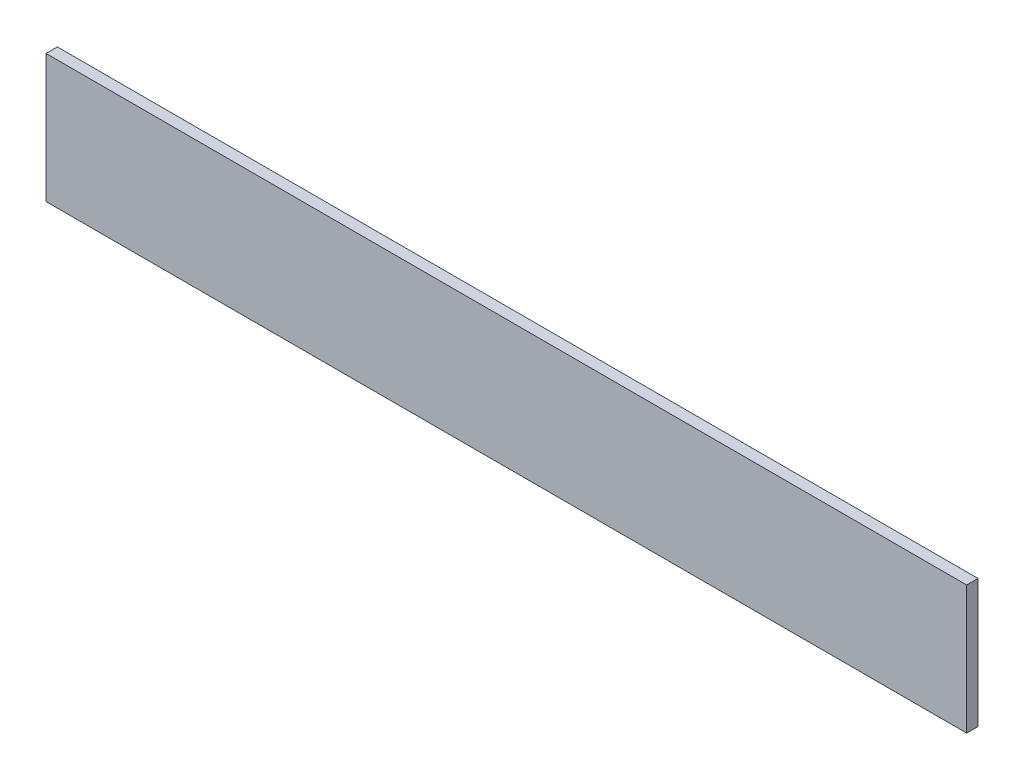
ISO-10303-21;
HEADER;
FILE_DESCRIPTION(('STEP AP214'),'2;1');
FILE_NAME('part.step','',(''),(''),'','','');
FILE_SCHEMA(('AUTOMOTIVE_DESIGN { 1 0 10303 214 1 1 1 1 }'));
ENDSEC;
DATA;
#1=APPLICATION_CONTEXT('core data for automotive mechanical design processes');
#2=APPLICATION_PROTOCOL_DEFINITION('international standard','automotive_design',2000,#1);
#3=PRODUCT_CONTEXT('',#1,'mechanical');
#4=PRODUCT('Part','Part','',(#3));
#5=PRODUCT_RELATED_PRODUCT_CATEGORY('part','',(#4));
#6=PRODUCT_DEFINITION_FORMATION('','',#4);
#7=PRODUCT_DEFINITION_CONTEXT('part definition',#1,'design');
#8=PRODUCT_DEFINITION('design','',#6,#7);
#9=PRODUCT_DEFINITION_SHAPE('','',#8);
#10=(LENGTH_UNIT() NAMED_UNIT(*) SI_UNIT(.MILLI.,.METRE.));
#11=(NAMED_UNIT(*) PLANE_ANGLE_UNIT() SI_UNIT($,.RADIAN.));
#12=(NAMED_UNIT(*) SI_UNIT($,.STERADIAN.) SOLID_ANGLE_UNIT());
#13=UNCERTAINTY_MEASURE_WITH_UNIT(LENGTH_MEASURE(1.E-05),#10,'distance_accuracy_value','');
#14=(GEOMETRIC_REPRESENTATION_CONTEXT(3) GLOBAL_UNCERTAINTY_ASSIGNED_CONTEXT((#13)) GLOBAL_UNIT_ASSIGNED_CONTEXT((#10,
#11,#12)) REPRESENTATION_CONTEXT('',''));
#15=CARTESIAN_POINT('',(0.,0.,0.));
#16=DIRECTION('',(0.,0.,1.));
#17=DIRECTION('',(1.,0.,0.));
#18=AXIS2_PLACEMENT_3D('',#15,#16,#17);
#19=CARTESIAN_POINT('',(61.,-8.5,1.5));
#20=DIRECTION('',(-1.,0.,0.));
#21=DIRECTION('',(0.,0.,1.));
#22=AXIS2_PLACEMENT_3D('',#19,#20,#21);
#23=PLANE('',#22);
#24=DIRECTION('',(0.,1.,0.));
#25=VECTOR('',#24,1.);
#26=CARTESIAN_POINT('',(61.,-8.5,0.));
#27=LINE('',#26,#25);
#28=CARTESIAN_POINT('',(61.,-8.5,0.));
#29=VERTEX_POINT('',#28);
#30=CARTESIAN_POINT('',(61.,8.5,0.));
#31=VERTEX_POINT('',#30);
#32=EDGE_CURVE('E96',#29,#31,#27,.T.);
#33=ORIENTED_EDGE('',*,*,#32,.T.);
#34=DIRECTION('',(0.,0.,-1.));
#35=VECTOR('',#34,1.);
#36=CARTESIAN_POINT('',(61.,8.5,1.5));
#37=LINE('',#36,#35);
#38=CARTESIAN_POINT('',(61.,8.5,1.5));
#39=VERTEX_POINT('',#38);
#40=EDGE_CURVE('E11',#39,#31,#37,.T.);
#41=ORIENTED_EDGE('',*,*,#40,.F.);
#42=DIRECTION('',(0.,1.,0.));
#43=VECTOR('',#42,1.);
#44=CARTESIAN_POINT('',(61.,-8.5,1.5));
#45=LINE('',#44,#43);
#46=CARTESIAN_POINT('',(61.,-8.5,1.5));
#47=VERTEX_POINT('',#46);
#48=EDGE_CURVE('E84',#47,#39,#45,.T.);
#49=ORIENTED_EDGE('',*,*,#48,.F.);
#50=DIRECTION('',(0.,0.,-1.));
#51=VECTOR('',#50,1.);
#52=CARTESIAN_POINT('',(61.,-8.5,1.5));
#53=LINE('',#52,#51);
#54=EDGE_CURVE('E92',#47,#29,#53,.T.);
#55=ORIENTED_EDGE('',*,*,#54,.T.);
#56=EDGE_LOOP('',(#33,#41,#49,#55));
#57=FACE_BOUND('',#56,.T.);
#58=ADVANCED_FACE('F33',(#57),#23,.F.);
#59=CARTESIAN_POINT('',(-61.,8.5,1.5));
#60=DIRECTION('',(0.,-1.,0.));
#61=DIRECTION('',(0.,0.,-1.));
#62=AXIS2_PLACEMENT_3D('',#59,#60,#61);
#63=PLANE('',#62);
#64=DIRECTION('',(-1.,0.,0.));
#65=VECTOR('',#64,1.);
#66=CARTESIAN_POINT('',(-61.,8.5,0.));
#67=LINE('',#66,#65);
#68=CARTESIAN_POINT('',(-61.,8.5,0.));
#69=VERTEX_POINT('',#68);
#70=EDGE_CURVE('E88',#31,#69,#67,.T.);
#71=ORIENTED_EDGE('',*,*,#70,.T.);
#72=DIRECTION('',(0.,0.,-1.));
#73=VECTOR('',#72,1.);
#74=CARTESIAN_POINT('',(-61.,8.5,1.5));
#75=LINE('',#74,#73);
#76=CARTESIAN_POINT('',(-61.,8.5,1.5));
#77=VERTEX_POINT('',#76);
#78=EDGE_CURVE('E41',#77,#69,#75,.T.);
#79=ORIENTED_EDGE('',*,*,#78,.F.);
#80=DIRECTION('',(-1.,0.,0.));
#81=VECTOR('',#80,1.);
#82=CARTESIAN_POINT('',(-61.,8.5,1.5));
#83=LINE('',#82,#81);
#84=EDGE_CURVE('E79',#39,#77,#83,.T.);
#85=ORIENTED_EDGE('',*,*,#84,.F.);
#86=ORIENTED_EDGE('',*,*,#40,.T.);
#87=EDGE_LOOP('',(#71,#79,#85,#86));
#88=FACE_BOUND('',#87,.T.);
#89=ADVANCED_FACE('F87',(#88),#63,.F.);
#90=CARTESIAN_POINT('',(-61.,-8.5,1.5));
#91=DIRECTION('',(1.,0.,0.));
#92=DIRECTION('',(0.,0.,-1.));
#93=AXIS2_PLACEMENT_3D('',#90,#91,#92);
#94=PLANE('',#93);
#95=DIRECTION('',(0.,-1.,0.));
#96=VECTOR('',#95,1.);
#97=CARTESIAN_POINT('',(-61.,-8.5,0.));
#98=LINE('',#97,#96);
#99=CARTESIAN_POINT('',(-61.,-8.5,0.));
#100=VERTEX_POINT('',#99);
#101=EDGE_CURVE('E66',#69,#100,#98,.T.);
#102=ORIENTED_EDGE('',*,*,#101,.T.);
#103=DIRECTION('',(0.,0.,-1.));
#104=VECTOR('',#103,1.);
#105=CARTESIAN_POINT('',(-61.,-8.5,1.5));
#106=LINE('',#105,#104);
#107=CARTESIAN_POINT('',(-61.,-8.5,1.5));
#108=VERTEX_POINT('',#107);
#109=EDGE_CURVE('E89',#108,#100,#106,.T.);
#110=ORIENTED_EDGE('',*,*,#109,.F.);
#111=DIRECTION('',(0.,-1.,0.));
#112=VECTOR('',#111,1.);
#113=CARTESIAN_POINT('',(-61.,-8.5,1.5));
#114=LINE('',#113,#112);
#115=EDGE_CURVE('E82',#77,#108,#114,.T.);
#116=ORIENTED_EDGE('',*,*,#115,.F.);
#117=ORIENTED_EDGE('',*,*,#78,.T.);
#118=EDGE_LOOP('',(#102,#110,#116,#117));
#119=FACE_BOUND('',#118,.T.);
#120=ADVANCED_FACE('F90',(#119),#94,.F.);
#121=CARTESIAN_POINT('',(-61.,-8.5,1.5));
#122=DIRECTION('',(0.,1.,0.));
#123=DIRECTION('',(-1.,0.,0.));
#124=AXIS2_PLACEMENT_3D('',#121,#122,#123);
#125=PLANE('',#124);
#126=DIRECTION('',(1.,0.,0.));
#127=VECTOR('',#126,1.);
#128=CARTESIAN_POINT('',(-61.,-8.5,0.));
#129=LINE('',#128,#127);
#130=EDGE_CURVE('E72',#100,#29,#129,.T.);
#131=ORIENTED_EDGE('',*,*,#130,.T.);
#132=ORIENTED_EDGE('',*,*,#54,.F.);
#133=DIRECTION('',(1.,0.,0.));
#134=VECTOR('',#133,1.);
#135=CARTESIAN_POINT('',(-61.,-8.5,1.5));
#136=LINE('',#135,#134);
#137=EDGE_CURVE('E49',#108,#47,#136,.T.);
#138=ORIENTED_EDGE('',*,*,#137,.F.);
#139=ORIENTED_EDGE('',*,*,#109,.T.);
#140=EDGE_LOOP('',(#131,#132,#138,#139));
#141=FACE_BOUND('',#140,.T.);
#142=ADVANCED_FACE('F103',(#141),#125,.F.);
#143=CARTESIAN_POINT('',(0.,0.,1.5));
#144=DIRECTION('',(0.,0.,-1.));
#145=DIRECTION('',(-1.,0.,0.));
#146=AXIS2_PLACEMENT_3D('',#143,#144,#145);
#147=PLANE('',#146);
#148=ORIENTED_EDGE('',*,*,#48,.T.);
#149=ORIENTED_EDGE('',*,*,#84,.T.);
#150=ORIENTED_EDGE('',*,*,#115,.T.);
#151=ORIENTED_EDGE('',*,*,#137,.T.);
#152=EDGE_LOOP('',(#148,#149,#150,#151));
#153=FACE_BOUND('',#152,.T.);
#154=ADVANCED_FACE('F80',(#153),#147,.F.);
#155=CARTESIAN_POINT('',(0.,0.,0.));
#156=DIRECTION('',(0.,0.,-1.));
#157=DIRECTION('',(-1.,0.,0.));
#158=AXIS2_PLACEMENT_3D('',#155,#156,#157);
#159=PLANE('',#158);
#160=ORIENTED_EDGE('',*,*,#32,.F.);
#161=ORIENTED_EDGE('',*,*,#130,.F.);
#162=ORIENTED_EDGE('',*,*,#101,.F.);
#163=ORIENTED_EDGE('',*,*,#70,.F.);
#164=EDGE_LOOP('',(#160,#161,#162,#163));
#165=FACE_BOUND('',#164,.T.);
#166=ADVANCED_FACE('F106',(#165),#159,.T.);
#167=CLOSED_SHELL('',(#58,#89,#120,#142,#154,#166));
#168=MANIFOLD_SOLID_BREP('B2',#167);
#169=ADVANCED_BREP_SHAPE_REPRESENTATION('',(#18,#168),#14);
#170=SHAPE_DEFINITION_REPRESENTATION(#9,#169);
ENDSEC;
END-ISO-10303-21;
